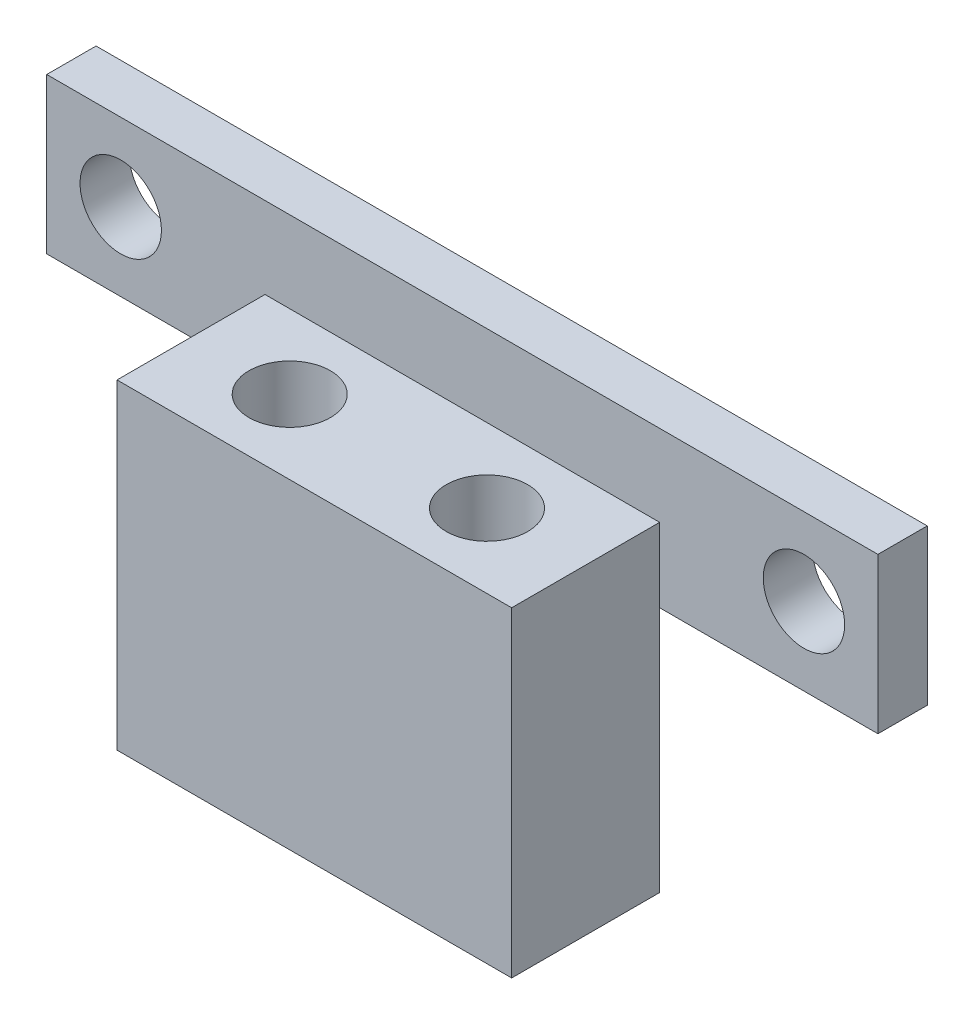
ISO-10303-21;
HEADER;
FILE_DESCRIPTION(('STEP AP214'),'2;1');
FILE_NAME('part.step','',(''),(''),'','','');
FILE_SCHEMA(('AUTOMOTIVE_DESIGN { 1 0 10303 214 1 1 1 1 }'));
ENDSEC;
DATA;
#1=APPLICATION_CONTEXT('core data for automotive mechanical design processes');
#2=APPLICATION_PROTOCOL_DEFINITION('international standard','automotive_design',2000,#1);
#3=PRODUCT_CONTEXT('',#1,'mechanical');
#4=PRODUCT('Part','Part','',(#3));
#5=PRODUCT_RELATED_PRODUCT_CATEGORY('part','',(#4));
#6=PRODUCT_DEFINITION_FORMATION('','',#4);
#7=PRODUCT_DEFINITION_CONTEXT('part definition',#1,'design');
#8=PRODUCT_DEFINITION('design','',#6,#7);
#9=PRODUCT_DEFINITION_SHAPE('','',#8);
#10=(LENGTH_UNIT() NAMED_UNIT(*) SI_UNIT(.MILLI.,.METRE.));
#11=(NAMED_UNIT(*) PLANE_ANGLE_UNIT() SI_UNIT($,.RADIAN.));
#12=(NAMED_UNIT(*) SI_UNIT($,.STERADIAN.) SOLID_ANGLE_UNIT());
#13=UNCERTAINTY_MEASURE_WITH_UNIT(LENGTH_MEASURE(1.E-05),#10,'distance_accuracy_value','');
#14=(GEOMETRIC_REPRESENTATION_CONTEXT(3) GLOBAL_UNCERTAINTY_ASSIGNED_CONTEXT((#13)) GLOBAL_UNIT_ASSIGNED_CONTEXT((#10,
#11,#12)) REPRESENTATION_CONTEXT('',''));
#15=CARTESIAN_POINT('',(0.,0.,0.));
#16=DIRECTION('',(0.,0.,1.));
#17=DIRECTION('',(1.,0.,0.));
#18=AXIS2_PLACEMENT_3D('',#15,#16,#17);
#19=CARTESIAN_POINT('',(0.,0.,2.));
#20=DIRECTION('',(0.,1.,0.));
#21=DIRECTION('',(0.,0.,1.));
#22=AXIS2_PLACEMENT_3D('',#19,#20,#21);
#23=PLANE('',#22);
#24=DIRECTION('',(1.,0.,0.));
#25=VECTOR('',#24,1.);
#26=CARTESIAN_POINT('',(8.85,0.,2.));
#27=LINE('',#26,#25);
#28=CARTESIAN_POINT('',(8.85,0.,2.));
#29=VERTEX_POINT('',#28);
#30=CARTESIAN_POINT('',(24.85,0.,2.));
#31=VERTEX_POINT('',#30);
#32=EDGE_CURVE('E62',#29,#31,#27,.T.);
#33=ORIENTED_EDGE('',*,*,#32,.F.);
#34=DIRECTION('',(1.,0.,0.));
#35=VECTOR('',#34,1.);
#36=CARTESIAN_POINT('',(0.,0.,2.));
#37=LINE('',#36,#35);
#38=CARTESIAN_POINT('',(0.,0.,2.));
#39=VERTEX_POINT('',#38);
#40=EDGE_CURVE('E179',#39,#29,#37,.T.);
#41=ORIENTED_EDGE('',*,*,#40,.F.);
#42=DIRECTION('',(0.,0.,-1.));
#43=VECTOR('',#42,1.);
#44=CARTESIAN_POINT('',(0.,0.,2.));
#45=LINE('',#44,#43);
#46=CARTESIAN_POINT('',(0.,0.,0.));
#47=VERTEX_POINT('',#46);
#48=EDGE_CURVE('E11',#39,#47,#45,.T.);
#49=ORIENTED_EDGE('',*,*,#48,.T.);
#50=DIRECTION('',(1.,0.,0.));
#51=VECTOR('',#50,1.);
#52=CARTESIAN_POINT('',(0.,0.,0.));
#53=LINE('',#52,#51);
#54=CARTESIAN_POINT('',(33.7,0.,0.));
#55=VERTEX_POINT('',#54);
#56=EDGE_CURVE('E188',#47,#55,#53,.T.);
#57=ORIENTED_EDGE('',*,*,#56,.T.);
#58=DIRECTION('',(0.,0.,-1.));
#59=VECTOR('',#58,1.);
#60=CARTESIAN_POINT('',(33.7,0.,2.));
#61=LINE('',#60,#59);
#62=CARTESIAN_POINT('',(33.7,0.,2.));
#63=VERTEX_POINT('',#62);
#64=EDGE_CURVE('E47',#63,#55,#61,.T.);
#65=ORIENTED_EDGE('',*,*,#64,.F.);
#66=EDGE_CURVE('E177',#31,#63,#37,.T.);
#67=ORIENTED_EDGE('',*,*,#66,.F.);
#68=EDGE_LOOP('',(#33,#41,#49,#57,#65,#67));
#69=FACE_BOUND('',#68,.T.);
#70=ADVANCED_FACE('F39',(#69),#23,.F.);
#71=CARTESIAN_POINT('',(0.,0.,2.));
#72=DIRECTION('',(0.,0.,-1.));
#73=DIRECTION('',(-1.,0.,0.));
#74=AXIS2_PLACEMENT_3D('',#71,#72,#73);
#75=PLANE('',#74);
#76=CARTESIAN_POINT('',(30.7,3.15,2.));
#77=DIRECTION('',(0.,0.,1.));
#78=DIRECTION('',(1.,0.,0.));
#79=AXIS2_PLACEMENT_3D('',#76,#77,#78);
#80=CIRCLE('',#79,1.65);
#81=CARTESIAN_POINT('',(32.35,3.15,2.));
#82=VERTEX_POINT('',#81);
#83=EDGE_CURVE('E162',#82,#82,#80,.T.);
#84=ORIENTED_EDGE('',*,*,#83,.F.);
#85=EDGE_LOOP('',(#84));
#86=FACE_BOUND('',#85,.T.);
#87=CARTESIAN_POINT('',(3.,3.15,2.));
#88=DIRECTION('',(0.,0.,1.));
#89=DIRECTION('',(1.,0.,0.));
#90=AXIS2_PLACEMENT_3D('',#87,#88,#89);
#91=CIRCLE('',#90,1.65);
#92=CARTESIAN_POINT('',(4.65,3.15,2.));
#93=VERTEX_POINT('',#92);
#94=EDGE_CURVE('E168',#93,#93,#91,.T.);
#95=ORIENTED_EDGE('',*,*,#94,.F.);
#96=EDGE_LOOP('',(#95));
#97=FACE_BOUND('',#96,.T.);
#98=DIRECTION('',(0.,-1.,0.));
#99=VECTOR('',#98,1.);
#100=CARTESIAN_POINT('',(8.85,0.,2.));
#101=LINE('',#100,#99);
#102=CARTESIAN_POINT('',(8.85,3.,2.));
#103=VERTEX_POINT('',#102);
#104=EDGE_CURVE('E54',#103,#29,#101,.T.);
#105=ORIENTED_EDGE('',*,*,#104,.F.);
#106=DIRECTION('',(-1.,0.,0.));
#107=VECTOR('',#106,1.);
#108=CARTESIAN_POINT('',(8.85,3.,2.));
#109=LINE('',#108,#107);
#110=CARTESIAN_POINT('',(24.85,3.,2.));
#111=VERTEX_POINT('',#110);
#112=EDGE_CURVE('E147',#111,#103,#109,.T.);
#113=ORIENTED_EDGE('',*,*,#112,.F.);
#114=DIRECTION('',(0.,1.,0.));
#115=VECTOR('',#114,1.);
#116=CARTESIAN_POINT('',(24.85,0.,2.));
#117=LINE('',#116,#115);
#118=EDGE_CURVE('E153',#31,#111,#117,.T.);
#119=ORIENTED_EDGE('',*,*,#118,.F.);
#120=ORIENTED_EDGE('',*,*,#66,.T.);
#121=DIRECTION('',(0.,1.,0.));
#122=VECTOR('',#121,1.);
#123=CARTESIAN_POINT('',(33.7,0.,2.));
#124=LINE('',#123,#122);
#125=CARTESIAN_POINT('',(33.7,6.3,2.));
#126=VERTEX_POINT('',#125);
#127=EDGE_CURVE('E181',#63,#126,#124,.T.);
#128=ORIENTED_EDGE('',*,*,#127,.T.);
#129=DIRECTION('',(-1.,0.,0.));
#130=VECTOR('',#129,1.);
#131=CARTESIAN_POINT('',(0.,6.3,2.));
#132=LINE('',#131,#130);
#133=CARTESIAN_POINT('',(0.,6.3,2.));
#134=VERTEX_POINT('',#133);
#135=EDGE_CURVE('E183',#126,#134,#132,.T.);
#136=ORIENTED_EDGE('',*,*,#135,.T.);
#137=DIRECTION('',(0.,-1.,0.));
#138=VECTOR('',#137,1.);
#139=CARTESIAN_POINT('',(0.,0.,2.));
#140=LINE('',#139,#138);
#141=EDGE_CURVE('E174',#134,#39,#140,.T.);
#142=ORIENTED_EDGE('',*,*,#141,.T.);
#143=ORIENTED_EDGE('',*,*,#40,.T.);
#144=EDGE_LOOP('',(#105,#113,#119,#120,#128,#136,#142,#143));
#145=FACE_BOUND('',#144,.T.);
#146=ADVANCED_FACE('F216',(#86,#97,#145),#75,.F.);
#147=CARTESIAN_POINT('',(0.,0.,0.));
#148=DIRECTION('',(0.,0.,-1.));
#149=DIRECTION('',(-1.,0.,0.));
#150=AXIS2_PLACEMENT_3D('',#147,#148,#149);
#151=PLANE('',#150);
#152=CARTESIAN_POINT('',(3.,3.15,0.));
#153=DIRECTION('',(0.,0.,1.));
#154=DIRECTION('',(1.,0.,0.));
#155=AXIS2_PLACEMENT_3D('',#152,#153,#154);
#156=CIRCLE('',#155,1.65);
#157=CARTESIAN_POINT('',(4.65,3.15,0.));
#158=VERTEX_POINT('',#157);
#159=EDGE_CURVE('E165',#158,#158,#156,.T.);
#160=ORIENTED_EDGE('',*,*,#159,.T.);
#161=EDGE_LOOP('',(#160));
#162=FACE_BOUND('',#161,.T.);
#163=DIRECTION('',(0.,-1.,0.));
#164=VECTOR('',#163,1.);
#165=CARTESIAN_POINT('',(0.,0.,0.));
#166=LINE('',#165,#164);
#167=CARTESIAN_POINT('',(0.,6.3,0.));
#168=VERTEX_POINT('',#167);
#169=EDGE_CURVE('E171',#168,#47,#166,.T.);
#170=ORIENTED_EDGE('',*,*,#169,.F.);
#171=DIRECTION('',(-1.,0.,0.));
#172=VECTOR('',#171,1.);
#173=CARTESIAN_POINT('',(0.,6.3,0.));
#174=LINE('',#173,#172);
#175=CARTESIAN_POINT('',(33.7,6.3,0.));
#176=VERTEX_POINT('',#175);
#177=EDGE_CURVE('E178',#176,#168,#174,.T.);
#178=ORIENTED_EDGE('',*,*,#177,.F.);
#179=DIRECTION('',(0.,1.,0.));
#180=VECTOR('',#179,1.);
#181=CARTESIAN_POINT('',(33.7,0.,0.));
#182=LINE('',#181,#180);
#183=EDGE_CURVE('E190',#55,#176,#182,.T.);
#184=ORIENTED_EDGE('',*,*,#183,.F.);
#185=ORIENTED_EDGE('',*,*,#56,.F.);
#186=EDGE_LOOP('',(#170,#178,#184,#185));
#187=FACE_BOUND('',#186,.T.);
#188=CARTESIAN_POINT('',(30.7,3.15,0.));
#189=DIRECTION('',(0.,0.,1.));
#190=DIRECTION('',(1.,0.,0.));
#191=AXIS2_PLACEMENT_3D('',#188,#189,#190);
#192=CIRCLE('',#191,1.65);
#193=CARTESIAN_POINT('',(32.35,3.15,0.));
#194=VERTEX_POINT('',#193);
#195=EDGE_CURVE('E161',#194,#194,#192,.T.);
#196=ORIENTED_EDGE('',*,*,#195,.T.);
#197=EDGE_LOOP('',(#196));
#198=FACE_BOUND('',#197,.T.);
#199=ADVANCED_FACE('F207',(#162,#187,#198),#151,.T.);
#200=CARTESIAN_POINT('',(0.,0.,2.));
#201=DIRECTION('',(1.,0.,0.));
#202=DIRECTION('',(0.,0.,-1.));
#203=AXIS2_PLACEMENT_3D('',#200,#201,#202);
#204=PLANE('',#203);
#205=ORIENTED_EDGE('',*,*,#169,.T.);
#206=ORIENTED_EDGE('',*,*,#48,.F.);
#207=ORIENTED_EDGE('',*,*,#141,.F.);
#208=DIRECTION('',(0.,0.,-1.));
#209=VECTOR('',#208,1.);
#210=CARTESIAN_POINT('',(0.,6.3,2.));
#211=LINE('',#210,#209);
#212=EDGE_CURVE('E185',#134,#168,#211,.T.);
#213=ORIENTED_EDGE('',*,*,#212,.T.);
#214=EDGE_LOOP('',(#205,#206,#207,#213));
#215=FACE_BOUND('',#214,.T.);
#216=ADVANCED_FACE('F41',(#215),#204,.F.);
#217=CARTESIAN_POINT('',(33.7,0.,2.));
#218=DIRECTION('',(-1.,0.,0.));
#219=DIRECTION('',(0.,0.,1.));
#220=AXIS2_PLACEMENT_3D('',#217,#218,#219);
#221=PLANE('',#220);
#222=ORIENTED_EDGE('',*,*,#183,.T.);
#223=DIRECTION('',(0.,0.,-1.));
#224=VECTOR('',#223,1.);
#225=CARTESIAN_POINT('',(33.7,6.3,2.));
#226=LINE('',#225,#224);
#227=EDGE_CURVE('E195',#126,#176,#226,.T.);
#228=ORIENTED_EDGE('',*,*,#227,.F.);
#229=ORIENTED_EDGE('',*,*,#127,.F.);
#230=ORIENTED_EDGE('',*,*,#64,.T.);
#231=EDGE_LOOP('',(#222,#228,#229,#230));
#232=FACE_BOUND('',#231,.T.);
#233=ADVANCED_FACE('F202',(#232),#221,.F.);
#234=CARTESIAN_POINT('',(0.,6.3,2.));
#235=DIRECTION('',(0.,-1.,0.));
#236=DIRECTION('',(0.,0.,-1.));
#237=AXIS2_PLACEMENT_3D('',#234,#235,#236);
#238=PLANE('',#237);
#239=ORIENTED_EDGE('',*,*,#177,.T.);
#240=ORIENTED_EDGE('',*,*,#212,.F.);
#241=ORIENTED_EDGE('',*,*,#135,.F.);
#242=ORIENTED_EDGE('',*,*,#227,.T.);
#243=EDGE_LOOP('',(#239,#240,#241,#242));
#244=FACE_BOUND('',#243,.T.);
#245=ADVANCED_FACE('F211',(#244),#238,.F.);
#246=CARTESIAN_POINT('',(3.,3.15,2.));
#247=DIRECTION('',(0.,0.,-1.));
#248=DIRECTION('',(-1.,0.,0.));
#249=AXIS2_PLACEMENT_3D('',#246,#247,#248);
#250=CYLINDRICAL_SURFACE('',#249,1.65);
#251=ORIENTED_EDGE('',*,*,#94,.T.);
#252=EDGE_LOOP('',(#251));
#253=FACE_BOUND('',#252,.T.);
#254=ORIENTED_EDGE('',*,*,#159,.F.);
#255=EDGE_LOOP('',(#254));
#256=FACE_BOUND('',#255,.T.);
#257=ADVANCED_FACE('F230',(#253,#256),#250,.F.);
#258=CARTESIAN_POINT('',(30.7,3.15,2.));
#259=DIRECTION('',(0.,0.,-1.));
#260=DIRECTION('',(-1.,0.,0.));
#261=AXIS2_PLACEMENT_3D('',#258,#259,#260);
#262=CYLINDRICAL_SURFACE('',#261,1.65);
#263=ORIENTED_EDGE('',*,*,#83,.T.);
#264=EDGE_LOOP('',(#263));
#265=FACE_BOUND('',#264,.T.);
#266=ORIENTED_EDGE('',*,*,#195,.F.);
#267=EDGE_LOOP('',(#266));
#268=FACE_BOUND('',#267,.T.);
#269=ADVANCED_FACE('F236',(#265,#268),#262,.F.);
#270=CARTESIAN_POINT('',(8.85,0.,8.));
#271=DIRECTION('',(1.,0.,0.));
#272=DIRECTION('',(0.,0.,-1.));
#273=AXIS2_PLACEMENT_3D('',#270,#271,#272);
#274=PLANE('',#273);
#275=ORIENTED_EDGE('',*,*,#104,.T.);
#276=DIRECTION('',(0.,1.,0.));
#277=VECTOR('',#276,1.);
#278=CARTESIAN_POINT('',(8.85,-10.,2.));
#279=LINE('',#278,#277);
#280=CARTESIAN_POINT('',(8.85,-10.,2.));
#281=VERTEX_POINT('',#280);
#282=EDGE_CURVE('E114',#281,#29,#279,.T.);
#283=ORIENTED_EDGE('',*,*,#282,.F.);
#284=DIRECTION('',(0.,0.,-1.));
#285=VECTOR('',#284,1.);
#286=CARTESIAN_POINT('',(8.85,-10.,8.));
#287=LINE('',#286,#285);
#288=CARTESIAN_POINT('',(8.85,-10.,8.));
#289=VERTEX_POINT('',#288);
#290=EDGE_CURVE('E121',#289,#281,#287,.T.);
#291=ORIENTED_EDGE('',*,*,#290,.F.);
#292=DIRECTION('',(0.,-1.,0.));
#293=VECTOR('',#292,1.);
#294=CARTESIAN_POINT('',(8.85,0.,8.));
#295=LINE('',#294,#293);
#296=CARTESIAN_POINT('',(8.85,3.,8.));
#297=VERTEX_POINT('',#296);
#298=EDGE_CURVE('E144',#297,#289,#295,.T.);
#299=ORIENTED_EDGE('',*,*,#298,.F.);
#300=DIRECTION('',(0.,0.,-1.));
#301=VECTOR('',#300,1.);
#302=CARTESIAN_POINT('',(8.85,3.,8.));
#303=LINE('',#302,#301);
#304=EDGE_CURVE('E151',#297,#103,#303,.T.);
#305=ORIENTED_EDGE('',*,*,#304,.T.);
#306=EDGE_LOOP('',(#275,#283,#291,#299,#305));
#307=FACE_BOUND('',#306,.T.);
#308=ADVANCED_FACE('F132',(#307),#274,.F.);
#309=CARTESIAN_POINT('',(24.85,0.,8.));
#310=DIRECTION('',(-1.,0.,0.));
#311=DIRECTION('',(0.,0.,1.));
#312=AXIS2_PLACEMENT_3D('',#309,#310,#311);
#313=PLANE('',#312);
#314=ORIENTED_EDGE('',*,*,#118,.T.);
#315=DIRECTION('',(0.,0.,-1.));
#316=VECTOR('',#315,1.);
#317=CARTESIAN_POINT('',(24.85,3.,8.));
#318=LINE('',#317,#316);
#319=CARTESIAN_POINT('',(24.85,3.,8.));
#320=VERTEX_POINT('',#319);
#321=EDGE_CURVE('E158',#320,#111,#318,.T.);
#322=ORIENTED_EDGE('',*,*,#321,.F.);
#323=DIRECTION('',(0.,1.,0.));
#324=VECTOR('',#323,1.);
#325=CARTESIAN_POINT('',(24.85,0.,8.));
#326=LINE('',#325,#324);
#327=CARTESIAN_POINT('',(24.85,-10.,8.));
#328=VERTEX_POINT('',#327);
#329=EDGE_CURVE('E146',#328,#320,#326,.T.);
#330=ORIENTED_EDGE('',*,*,#329,.F.);
#331=DIRECTION('',(0.,0.,1.));
#332=VECTOR('',#331,1.);
#333=CARTESIAN_POINT('',(24.85,-10.,8.));
#334=LINE('',#333,#332);
#335=CARTESIAN_POINT('',(24.85,-10.,2.));
#336=VERTEX_POINT('',#335);
#337=EDGE_CURVE('E120',#336,#328,#334,.T.);
#338=ORIENTED_EDGE('',*,*,#337,.F.);
#339=DIRECTION('',(0.,1.,0.));
#340=VECTOR('',#339,1.);
#341=CARTESIAN_POINT('',(24.85,-10.,2.));
#342=LINE('',#341,#340);
#343=EDGE_CURVE('E116',#336,#31,#342,.T.);
#344=ORIENTED_EDGE('',*,*,#343,.T.);
#345=EDGE_LOOP('',(#314,#322,#330,#338,#344));
#346=FACE_BOUND('',#345,.T.);
#347=ADVANCED_FACE('F243',(#346),#313,.F.);
#348=CARTESIAN_POINT('',(8.85,3.,8.));
#349=DIRECTION('',(0.,-1.,0.));
#350=DIRECTION('',(0.,0.,-1.));
#351=AXIS2_PLACEMENT_3D('',#348,#349,#350);
#352=PLANE('',#351);
#353=CARTESIAN_POINT('',(12.85,3.,5.));
#354=DIRECTION('',(0.,1.,0.));
#355=DIRECTION('',(0.,0.,1.));
#356=AXIS2_PLACEMENT_3D('',#353,#354,#355);
#357=CIRCLE('',#356,1.65);
#358=CARTESIAN_POINT('',(12.85,3.,6.65));
#359=VERTEX_POINT('',#358);
#360=EDGE_CURVE('E137',#359,#359,#357,.T.);
#361=ORIENTED_EDGE('',*,*,#360,.F.);
#362=EDGE_LOOP('',(#361));
#363=FACE_BOUND('',#362,.T.);
#364=CARTESIAN_POINT('',(20.85,3.,5.));
#365=DIRECTION('',(0.,1.,0.));
#366=DIRECTION('',(0.,0.,1.));
#367=AXIS2_PLACEMENT_3D('',#364,#365,#366);
#368=CIRCLE('',#367,1.65);
#369=CARTESIAN_POINT('',(20.85,3.,6.65));
#370=VERTEX_POINT('',#369);
#371=EDGE_CURVE('E134',#370,#370,#368,.T.);
#372=ORIENTED_EDGE('',*,*,#371,.F.);
#373=EDGE_LOOP('',(#372));
#374=FACE_BOUND('',#373,.T.);
#375=ORIENTED_EDGE('',*,*,#112,.T.);
#376=ORIENTED_EDGE('',*,*,#304,.F.);
#377=DIRECTION('',(-1.,0.,0.));
#378=VECTOR('',#377,1.);
#379=CARTESIAN_POINT('',(8.85,3.,8.));
#380=LINE('',#379,#378);
#381=EDGE_CURVE('E149',#320,#297,#380,.T.);
#382=ORIENTED_EDGE('',*,*,#381,.F.);
#383=ORIENTED_EDGE('',*,*,#321,.T.);
#384=EDGE_LOOP('',(#375,#376,#382,#383));
#385=FACE_BOUND('',#384,.T.);
#386=ADVANCED_FACE('F246',(#363,#374,#385),#352,.F.);
#387=CARTESIAN_POINT('',(0.,0.,8.));
#388=DIRECTION('',(0.,0.,-1.));
#389=DIRECTION('',(-1.,0.,0.));
#390=AXIS2_PLACEMENT_3D('',#387,#388,#389);
#391=PLANE('',#390);
#392=ORIENTED_EDGE('',*,*,#298,.T.);
#393=DIRECTION('',(-1.,0.,0.));
#394=VECTOR('',#393,1.);
#395=CARTESIAN_POINT('',(8.85,-10.,8.));
#396=LINE('',#395,#394);
#397=EDGE_CURVE('E128',#328,#289,#396,.T.);
#398=ORIENTED_EDGE('',*,*,#397,.F.);
#399=ORIENTED_EDGE('',*,*,#329,.T.);
#400=ORIENTED_EDGE('',*,*,#381,.T.);
#401=EDGE_LOOP('',(#392,#398,#399,#400));
#402=FACE_BOUND('',#401,.T.);
#403=ADVANCED_FACE('F249',(#402),#391,.F.);
#404=CARTESIAN_POINT('',(20.85,-3.,5.));
#405=DIRECTION('',(0.,1.,0.));
#406=DIRECTION('',(0.,0.,1.));
#407=AXIS2_PLACEMENT_3D('',#404,#405,#406);
#408=CYLINDRICAL_SURFACE('',#407,1.65);
#409=ORIENTED_EDGE('',*,*,#371,.T.);
#410=EDGE_LOOP('',(#409));
#411=FACE_BOUND('',#410,.T.);
#412=CARTESIAN_POINT('',(20.85,-10.,5.));
#413=DIRECTION('',(0.,-1.,0.));
#414=DIRECTION('',(0.,0.,-1.));
#415=AXIS2_PLACEMENT_3D('',#412,#413,#414);
#416=CIRCLE('',#415,1.65);
#417=CARTESIAN_POINT('',(20.85,-10.,3.35));
#418=VERTEX_POINT('',#417);
#419=EDGE_CURVE('E272',#418,#418,#416,.T.);
#420=ORIENTED_EDGE('',*,*,#419,.T.);
#421=EDGE_LOOP('',(#420));
#422=FACE_BOUND('',#421,.T.);
#423=ADVANCED_FACE('F253',(#411,#422),#408,.F.);
#424=CARTESIAN_POINT('',(12.85,-3.,5.));
#425=DIRECTION('',(0.,1.,0.));
#426=DIRECTION('',(0.,0.,1.));
#427=AXIS2_PLACEMENT_3D('',#424,#425,#426);
#428=CYLINDRICAL_SURFACE('',#427,1.65);
#429=ORIENTED_EDGE('',*,*,#360,.T.);
#430=EDGE_LOOP('',(#429));
#431=FACE_BOUND('',#430,.T.);
#432=CARTESIAN_POINT('',(12.85,-10.,5.));
#433=DIRECTION('',(0.,-1.,0.));
#434=DIRECTION('',(0.,0.,-1.));
#435=AXIS2_PLACEMENT_3D('',#432,#433,#434);
#436=CIRCLE('',#435,1.65);
#437=CARTESIAN_POINT('',(12.85,-10.,3.35));
#438=VERTEX_POINT('',#437);
#439=EDGE_CURVE('E270',#438,#438,#436,.T.);
#440=ORIENTED_EDGE('',*,*,#439,.T.);
#441=EDGE_LOOP('',(#440));
#442=FACE_BOUND('',#441,.T.);
#443=ADVANCED_FACE('F257',(#431,#442),#428,.F.);
#444=CARTESIAN_POINT('',(0.,-10.,0.));
#445=DIRECTION('',(0.,-1.,0.));
#446=DIRECTION('',(0.,0.,-1.));
#447=AXIS2_PLACEMENT_3D('',#444,#445,#446);
#448=PLANE('',#447);
#449=ORIENTED_EDGE('',*,*,#439,.F.);
#450=EDGE_LOOP('',(#449));
#451=FACE_BOUND('',#450,.T.);
#452=ORIENTED_EDGE('',*,*,#290,.T.);
#453=DIRECTION('',(1.,0.,0.));
#454=VECTOR('',#453,1.);
#455=CARTESIAN_POINT('',(8.85,-10.,2.));
#456=LINE('',#455,#454);
#457=EDGE_CURVE('E110',#281,#336,#456,.T.);
#458=ORIENTED_EDGE('',*,*,#457,.T.);
#459=ORIENTED_EDGE('',*,*,#337,.T.);
#460=ORIENTED_EDGE('',*,*,#397,.T.);
#461=EDGE_LOOP('',(#452,#458,#459,#460));
#462=FACE_BOUND('',#461,.T.);
#463=ORIENTED_EDGE('',*,*,#419,.F.);
#464=EDGE_LOOP('',(#463));
#465=FACE_BOUND('',#464,.T.);
#466=ADVANCED_FACE('F125',(#451,#462,#465),#448,.T.);
#467=CARTESIAN_POINT('',(8.85,-10.,2.));
#468=DIRECTION('',(0.,0.,1.));
#469=DIRECTION('',(1.,0.,0.));
#470=AXIS2_PLACEMENT_3D('',#467,#468,#469);
#471=PLANE('',#470);
#472=ORIENTED_EDGE('',*,*,#32,.T.);
#473=ORIENTED_EDGE('',*,*,#343,.F.);
#474=ORIENTED_EDGE('',*,*,#457,.F.);
#475=ORIENTED_EDGE('',*,*,#282,.T.);
#476=EDGE_LOOP('',(#472,#473,#474,#475));
#477=FACE_BOUND('',#476,.T.);
#478=ADVANCED_FACE('F112',(#477),#471,.F.);
#479=CLOSED_SHELL('',(#70,#146,#199,#216,#233,#245,#257,#269,#308,#347,#386,#403,#423,#443,#466,#478));
#480=MANIFOLD_SOLID_BREP('B2',#479);
#481=ADVANCED_BREP_SHAPE_REPRESENTATION('',(#18,#480),#14);
#482=SHAPE_DEFINITION_REPRESENTATION(#9,#481);
ENDSEC;
END-ISO-10303-21;
